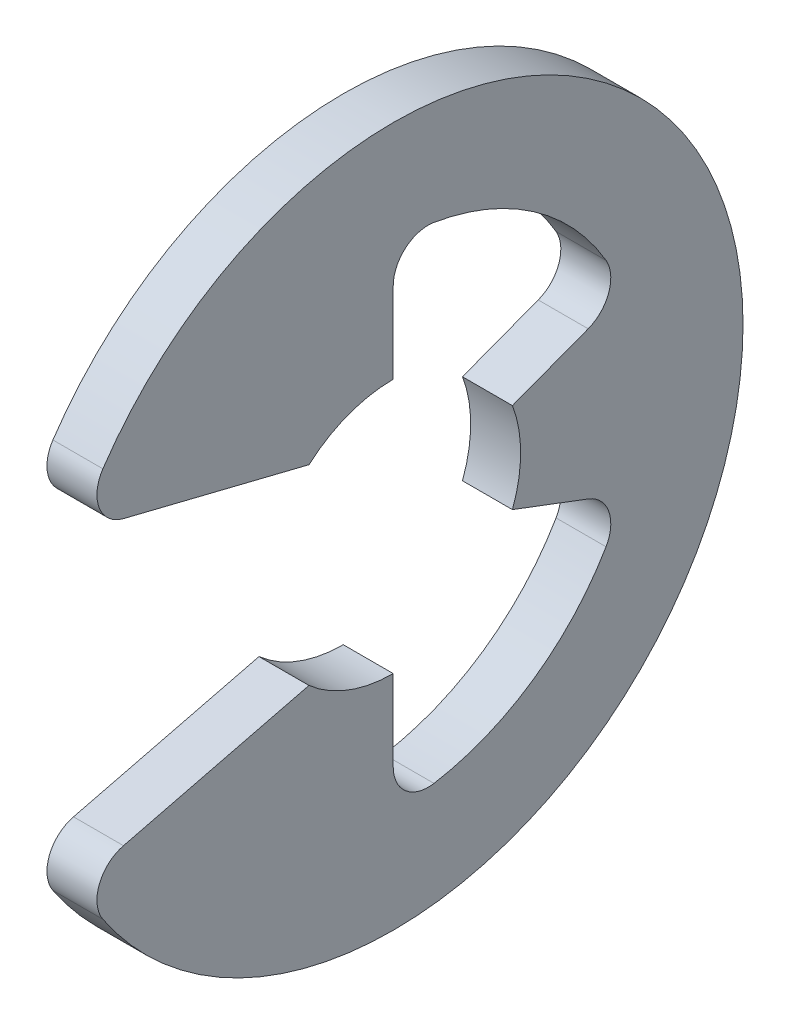
ISO-10303-21;
HEADER;
FILE_DESCRIPTION(('STEP AP214'),'2;1');
FILE_NAME('part.step','',(''),(''),'','','');
FILE_SCHEMA(('AUTOMOTIVE_DESIGN { 1 0 10303 214 1 1 1 1 }'));
ENDSEC;
DATA;
#1=APPLICATION_CONTEXT('core data for automotive mechanical design processes');
#2=APPLICATION_PROTOCOL_DEFINITION('international standard','automotive_design',2000,#1);
#3=PRODUCT_CONTEXT('',#1,'mechanical');
#4=PRODUCT('Part','Part','',(#3));
#5=PRODUCT_RELATED_PRODUCT_CATEGORY('part','',(#4));
#6=PRODUCT_DEFINITION_FORMATION('','',#4);
#7=PRODUCT_DEFINITION_CONTEXT('part definition',#1,'design');
#8=PRODUCT_DEFINITION('design','',#6,#7);
#9=PRODUCT_DEFINITION_SHAPE('','',#8);
#10=(LENGTH_UNIT() NAMED_UNIT(*) SI_UNIT(.MILLI.,.METRE.));
#11=(NAMED_UNIT(*) PLANE_ANGLE_UNIT() SI_UNIT($,.RADIAN.));
#12=(NAMED_UNIT(*) SI_UNIT($,.STERADIAN.) SOLID_ANGLE_UNIT());
#13=UNCERTAINTY_MEASURE_WITH_UNIT(LENGTH_MEASURE(1.E-05),#10,'distance_accuracy_value','');
#14=(GEOMETRIC_REPRESENTATION_CONTEXT(3) GLOBAL_UNCERTAINTY_ASSIGNED_CONTEXT((#13)) GLOBAL_UNIT_ASSIGNED_CONTEXT((#10,
#11,#12)) REPRESENTATION_CONTEXT('',''));
#15=CARTESIAN_POINT('',(0.,0.,0.));
#16=DIRECTION('',(0.,0.,1.));
#17=DIRECTION('',(1.,0.,0.));
#18=AXIS2_PLACEMENT_3D('',#15,#16,#17);
#19=CARTESIAN_POINT('',(-0.127,-1.799336,1.5257746472));
#20=DIRECTION('',(1.,0.,0.));
#21=DIRECTION('',(0.,0.,-1.));
#22=AXIS2_PLACEMENT_3D('',#19,#20,#21);
#23=PLANE('',#22);
#24=CARTESIAN_POINT('',(-0.127,-0.8923778698,1.3282702162));
#25=DIRECTION('',(-1.,0.,0.));
#26=DIRECTION('',(0.,-1.,0.));
#27=AXIS2_PLACEMENT_3D('',#24,#25,#26);
#28=CIRCLE('',#27,0.1778);
#29=CARTESIAN_POINT('',(-0.127,-0.991530970948213,1.47585579703794));
#30=VERTEX_POINT('',#29);
#31=CARTESIAN_POINT('',(-0.127,-0.719816418180298,1.37111162757117));
#32=VERTEX_POINT('',#31);
#33=EDGE_CURVE('E148',#30,#32,#28,.T.);
#34=ORIENTED_EDGE('',*,*,#33,.T.);
#35=DIRECTION('',(0.,0.240952810377831,-0.970536832464912));
#36=VECTOR('',#35,1.);
#37=CARTESIAN_POINT('',(-0.127,-0.6027957083,0.8997624626));
#38=LINE('',#37,#36);
#39=CARTESIAN_POINT('',(-0.127,-0.485774999078057,0.428413282089519));
#40=VERTEX_POINT('',#39);
#41=EDGE_CURVE('E147',#32,#40,#38,.T.);
#42=ORIENTED_EDGE('',*,*,#41,.T.);
#43=CARTESIAN_POINT('',(-0.127,0.,0.));
#44=DIRECTION('',(-1.,0.,0.));
#45=DIRECTION('',(0.,-1.,0.));
#46=AXIS2_PLACEMENT_3D('',#43,#44,#45);
#47=CIRCLE('',#46,0.6477);
#48=CARTESIAN_POINT('',(-0.127,-0.6477,-2.16789824564557E-10));
#49=VERTEX_POINT('',#48);
#50=EDGE_CURVE('E145',#49,#40,#47,.T.);
#51=ORIENTED_EDGE('',*,*,#50,.F.);
#52=DIRECTION('',(0.,1.,0.));
#53=VECTOR('',#52,1.);
#54=CARTESIAN_POINT('',(-0.127,0.,-1.84416067486315E-10));
#55=LINE('',#54,#53);
#56=CARTESIAN_POINT('',(-0.127,-1.059357038,-9.22080337431574E-11));
#57=VERTEX_POINT('',#56);
#58=EDGE_CURVE('E144',#57,#49,#55,.T.);
#59=ORIENTED_EDGE('',*,*,#58,.F.);
#60=CARTESIAN_POINT('',(-0.127,-1.059357038,-0.1778));
#61=DIRECTION('',(-1.,0.,0.));
#62=DIRECTION('',(0.,-1.,0.));
#63=AXIS2_PLACEMENT_3D('',#60,#61,#62);
#64=CIRCLE('',#63,0.1778);
#65=CARTESIAN_POINT('',(-0.127,-1.23470447799844,-0.20722990276032));
#66=VERTEX_POINT('',#65);
#67=EDGE_CURVE('E142',#66,#57,#64,.T.);
#68=ORIENTED_EDGE('',*,*,#67,.F.);
#69=CARTESIAN_POINT('',(-0.127,0.,0.));
#70=DIRECTION('',(-1.,0.,0.));
#71=DIRECTION('',(0.,-1.,0.));
#72=AXIS2_PLACEMENT_3D('',#69,#70,#71);
#73=CIRCLE('',#72,1.2519742042);
#74=CARTESIAN_POINT('',(-0.127,-0.630379775952262,-1.08169345699548));
#75=VERTEX_POINT('',#74);
#76=EDGE_CURVE('E140',#75,#66,#73,.T.);
#77=ORIENTED_EDGE('',*,*,#76,.F.);
#78=CARTESIAN_POINT('',(-0.127,-0.5408559414,-0.928075995));
#79=DIRECTION('',(-1.,0.,0.));
#80=DIRECTION('',(0.,-1.,0.));
#81=AXIS2_PLACEMENT_3D('',#78,#79,#80);
#82=CIRCLE('',#81,0.1778);
#83=CARTESIAN_POINT('',(-0.127,-0.374539275143704,-0.990937789013892));
#84=VERTEX_POINT('',#83);
#85=EDGE_CURVE('E138',#84,#75,#82,.T.);
#86=ORIENTED_EDGE('',*,*,#85,.F.);
#87=DIRECTION('',(0.,0.353553418854302,0.93541433601182));
#88=VECTOR('',#87,1.);
#89=CARTESIAN_POINT('',(-0.127,-0.3745392814,-0.990937794600001));
#90=LINE('',#89,#88);
#91=CARTESIAN_POINT('',(-0.127,-0.228996519461306,-0.605867876562199));
#92=VERTEX_POINT('',#91);
#93=EDGE_CURVE('E136',#92,#84,#90,.F.);
#94=ORIENTED_EDGE('',*,*,#93,.F.);
#95=CARTESIAN_POINT('',(-0.127,0.,0.));
#96=DIRECTION('',(-1.,0.,0.));
#97=DIRECTION('',(0.,-1.,0.));
#98=AXIS2_PLACEMENT_3D('',#95,#96,#97);
#99=CIRCLE('',#98,0.6477);
#100=CARTESIAN_POINT('',(-0.127,0.228996525208933,-0.605867874575171));
#101=VERTEX_POINT('',#100);
#102=EDGE_CURVE('E134',#101,#92,#99,.T.);
#103=ORIENTED_EDGE('',*,*,#102,.F.);
#104=DIRECTION('',(0.,0.353553418854302,-0.93541433601182));
#105=VECTOR('',#104,1.);
#106=CARTESIAN_POINT('',(-0.127,0.2289965194,-0.6058678764));
#107=LINE('',#106,#105);
#108=CARTESIAN_POINT('',(-0.127,0.374539280555376,-0.990937792365336));
#109=VERTEX_POINT('',#108);
#110=EDGE_CURVE('E132',#109,#101,#107,.F.);
#111=ORIENTED_EDGE('',*,*,#110,.F.);
#112=CARTESIAN_POINT('',(-0.127,0.5408559414,-0.928075995));
#113=DIRECTION('',(-1.,0.,0.));
#114=DIRECTION('',(0.,-1.,0.));
#115=AXIS2_PLACEMENT_3D('',#112,#113,#114);
#116=CIRCLE('',#115,0.1778);
#117=CARTESIAN_POINT('',(-0.127,0.630379772649934,-1.08169345891998));
#118=VERTEX_POINT('',#117);
#119=EDGE_CURVE('E130',#118,#109,#116,.T.);
#120=ORIENTED_EDGE('',*,*,#119,.F.);
#121=CARTESIAN_POINT('',(-0.127,0.,0.));
#122=DIRECTION('',(-1.,0.,0.));
#123=DIRECTION('',(0.,-1.,0.));
#124=AXIS2_PLACEMENT_3D('',#121,#122,#123);
#125=CIRCLE('',#124,1.2519742042);
#126=CARTESIAN_POINT('',(-0.127,1.23470447811351,-0.207229902074691));
#127=VERTEX_POINT('',#126);
#128=EDGE_CURVE('E128',#127,#118,#125,.T.);
#129=ORIENTED_EDGE('',*,*,#128,.F.);
#130=CARTESIAN_POINT('',(-0.127,1.059357038,-0.1778));
#131=DIRECTION('',(-1.,0.,0.));
#132=DIRECTION('',(0.,-1.,0.));
#133=AXIS2_PLACEMENT_3D('',#130,#131,#132);
#134=CIRCLE('',#133,0.1778);
#135=CARTESIAN_POINT('',(-0.127,1.059357038,-9.22080337431574E-11));
#136=VERTEX_POINT('',#135);
#137=EDGE_CURVE('E126',#136,#127,#134,.T.);
#138=ORIENTED_EDGE('',*,*,#137,.F.);
#139=DIRECTION('',(0.,1.,0.));
#140=VECTOR('',#139,1.);
#141=CARTESIAN_POINT('',(-0.127,0.,-1.84416067486315E-10));
#142=LINE('',#141,#140);
#143=CARTESIAN_POINT('',(-0.127,0.6477,-9.22080337431574E-11));
#144=VERTEX_POINT('',#143);
#145=EDGE_CURVE('E123',#144,#136,#142,.T.);
#146=ORIENTED_EDGE('',*,*,#145,.F.);
#147=CARTESIAN_POINT('',(-0.127,0.,0.));
#148=DIRECTION('',(-1.,0.,0.));
#149=DIRECTION('',(0.,-1.,0.));
#150=AXIS2_PLACEMENT_3D('',#147,#148,#149);
#151=CIRCLE('',#150,0.6477);
#152=CARTESIAN_POINT('',(-0.127,0.485774999035622,0.428413287115569));
#153=VERTEX_POINT('',#152);
#154=EDGE_CURVE('E122',#153,#144,#151,.T.);
#155=ORIENTED_EDGE('',*,*,#154,.F.);
#156=DIRECTION('',(0.,0.240952810377831,0.970536832464912));
#157=VECTOR('',#156,1.);
#158=CARTESIAN_POINT('',(-0.127,0.485775,0.428413291));
#159=LINE('',#158,#157);
#160=CARTESIAN_POINT('',(-0.127,0.719816418176451,1.37111162755568));
#161=VERTEX_POINT('',#160);
#162=EDGE_CURVE('E115',#161,#153,#159,.F.);
#163=ORIENTED_EDGE('',*,*,#162,.F.);
#164=CARTESIAN_POINT('',(-0.127,0.8923778698,1.3282702162));
#165=DIRECTION('',(-1.,0.,0.));
#166=DIRECTION('',(0.,-1.,0.));
#167=AXIS2_PLACEMENT_3D('',#164,#165,#166);
#168=CIRCLE('',#167,0.1778);
#169=CARTESIAN_POINT('',(-0.127,0.99153096688157,1.4758557959127));
#170=VERTEX_POINT('',#169);
#171=EDGE_CURVE('E19',#170,#161,#168,.F.);
#172=ORIENTED_EDGE('',*,*,#171,.F.);
#173=CARTESIAN_POINT('',(-0.127,0.,0.));
#174=DIRECTION('',(-1.,0.,0.));
#175=DIRECTION('',(0.,-1.,0.));
#176=AXIS2_PLACEMENT_3D('',#173,#174,#175);
#177=CIRCLE('',#176,1.778);
#178=EDGE_CURVE('E150',#170,#30,#177,.T.);
#179=ORIENTED_EDGE('',*,*,#178,.T.);
#180=EDGE_LOOP('',(#34,#42,#51,#59,#68,#77,#86,#94,#103,#111,#120,#129,#138,#146,#155,#163,#172,#179));
#181=FACE_BOUND('',#180,.T.);
#182=ADVANCED_FACE('F15',(#181),#23,.F.);
#183=CARTESIAN_POINT('',(-0.127,-0.7198164166,1.3711116342));
#184=DIRECTION('',(0.,-0.970536832464912,-0.240952810377831));
#185=DIRECTION('',(0.,0.240952810377831,-0.970536832464912));
#186=AXIS2_PLACEMENT_3D('',#183,#184,#185);
#187=PLANE('',#186);
#188=DIRECTION('',(-1.,0.,0.));
#189=VECTOR('',#188,1.);
#190=CARTESIAN_POINT('',(0.,-0.719816421450301,1.37111162774834));
#191=LINE('',#190,#189);
#192=CARTESIAN_POINT('',(0.127,-0.719816423595553,1.37111162716025));
#193=VERTEX_POINT('',#192);
#194=EDGE_CURVE('E151',#32,#193,#191,.F.);
#195=ORIENTED_EDGE('',*,*,#194,.T.);
#196=DIRECTION('',(0.,-0.240952820268791,0.970536830009308));
#197=VECTOR('',#196,1.);
#198=CARTESIAN_POINT('',(0.127,-0.48577499887224,0.428413283093616));
#199=LINE('',#198,#197);
#200=CARTESIAN_POINT('',(0.127,-0.485774999403899,0.428413281720049));
#201=VERTEX_POINT('',#200);
#202=EDGE_CURVE('E154',#201,#193,#199,.T.);
#203=ORIENTED_EDGE('',*,*,#202,.F.);
#204=DIRECTION('',(-1.,0.,0.));
#205=VECTOR('',#204,1.);
#206=CARTESIAN_POINT('',(0.,-0.485775000084871,0.428413280947899));
#207=LINE('',#206,#205);
#208=EDGE_CURVE('E240',#40,#201,#207,.F.);
#209=ORIENTED_EDGE('',*,*,#208,.F.);
#210=ORIENTED_EDGE('',*,*,#41,.F.);
#211=EDGE_LOOP('',(#195,#203,#209,#210));
#212=FACE_BOUND('',#211,.T.);
#213=ADVANCED_FACE('F265',(#212),#187,.F.);
#214=CARTESIAN_POINT('',(0.127,-0.8923778698,1.3282702162));
#215=DIRECTION('',(-1.,0.,0.));
#216=DIRECTION('',(0.,-1.,0.));
#217=AXIS2_PLACEMENT_3D('',#214,#215,#216);
#218=CYLINDRICAL_SURFACE('',#217,0.1778);
#219=CARTESIAN_POINT('',(0.127,-0.8923778698,1.3282702162));
#220=DIRECTION('',(-1.,0.,0.));
#221=DIRECTION('',(0.,-1.,0.));
#222=AXIS2_PLACEMENT_3D('',#219,#220,#221);
#223=CIRCLE('',#222,0.1778);
#224=CARTESIAN_POINT('',(0.127,-0.991530970948213,1.47585579703794));
#225=VERTEX_POINT('',#224);
#226=EDGE_CURVE('E157',#193,#225,#223,.F.);
#227=ORIENTED_EDGE('',*,*,#226,.F.);
#228=ORIENTED_EDGE('',*,*,#194,.F.);
#229=ORIENTED_EDGE('',*,*,#33,.F.);
#230=DIRECTION('',(-1.,0.,0.));
#231=VECTOR('',#230,1.);
#232=CARTESIAN_POINT('',(0.,-0.991530973468016,1.47585579534505));
#233=LINE('',#232,#231);
#234=EDGE_CURVE('E153',#30,#225,#233,.F.);
#235=ORIENTED_EDGE('',*,*,#234,.T.);
#236=EDGE_LOOP('',(#227,#228,#229,#235));
#237=FACE_BOUND('',#236,.T.);
#238=ADVANCED_FACE('F315',(#237),#218,.T.);
#239=CARTESIAN_POINT('',(0.127,0.,0.));
#240=DIRECTION('',(-1.,0.,0.));
#241=DIRECTION('',(0.,-1.,0.));
#242=AXIS2_PLACEMENT_3D('',#239,#240,#241);
#243=CYLINDRICAL_SURFACE('',#242,1.778);
#244=ORIENTED_EDGE('',*,*,#234,.F.);
#245=ORIENTED_EDGE('',*,*,#178,.F.);
#246=DIRECTION('',(-1.,0.,0.));
#247=VECTOR('',#246,1.);
#248=CARTESIAN_POINT('',(0.,0.991530967120298,1.47585579575231));
#249=LINE('',#248,#247);
#250=CARTESIAN_POINT('',(0.127,0.99153096688157,1.4758557959127));
#251=VERTEX_POINT('',#250);
#252=EDGE_CURVE('E111',#170,#251,#249,.F.);
#253=ORIENTED_EDGE('',*,*,#252,.T.);
#254=CARTESIAN_POINT('',(0.127,0.,0.));
#255=DIRECTION('',(-1.,0.,0.));
#256=DIRECTION('',(0.,-1.,0.));
#257=AXIS2_PLACEMENT_3D('',#254,#255,#256);
#258=CIRCLE('',#257,1.778);
#259=EDGE_CURVE('E160',#225,#251,#258,.F.);
#260=ORIENTED_EDGE('',*,*,#259,.F.);
#261=EDGE_LOOP('',(#244,#245,#253,#260));
#262=FACE_BOUND('',#261,.T.);
#263=ADVANCED_FACE('F313',(#262),#243,.T.);
#264=CARTESIAN_POINT('',(0.127,0.,0.));
#265=DIRECTION('',(-1.,0.,0.));
#266=DIRECTION('',(0.,-1.,0.));
#267=AXIS2_PLACEMENT_3D('',#264,#265,#266);
#268=CYLINDRICAL_SURFACE('',#267,0.6477);
#269=CARTESIAN_POINT('',(0.127,0.,0.));
#270=DIRECTION('',(-1.,0.,0.));
#271=DIRECTION('',(0.,-1.,0.));
#272=AXIS2_PLACEMENT_3D('',#269,#270,#271);
#273=CIRCLE('',#272,0.6477);
#274=CARTESIAN_POINT('',(0.127,0.485774999361464,0.428413286746099));
#275=VERTEX_POINT('',#274);
#276=CARTESIAN_POINT('',(0.127,0.6477,-9.22080337431574E-11));
#277=VERTEX_POINT('',#276);
#278=EDGE_CURVE('E164',#275,#277,#273,.T.);
#279=ORIENTED_EDGE('',*,*,#278,.F.);
#280=DIRECTION('',(-1.,0.,0.));
#281=VECTOR('',#280,1.);
#282=CARTESIAN_POINT('',(0.,0.485775,0.428413291));
#283=LINE('',#282,#281);
#284=EDGE_CURVE('E205',#275,#153,#283,.T.);
#285=ORIENTED_EDGE('',*,*,#284,.T.);
#286=ORIENTED_EDGE('',*,*,#154,.T.);
#287=DIRECTION('',(1.,0.,0.));
#288=VECTOR('',#287,1.);
#289=CARTESIAN_POINT('',(0.,0.6477,0.));
#290=LINE('',#289,#288);
#291=EDGE_CURVE('E203',#144,#277,#290,.T.);
#292=ORIENTED_EDGE('',*,*,#291,.T.);
#293=EDGE_LOOP('',(#279,#285,#286,#292));
#294=FACE_BOUND('',#293,.T.);
#295=ADVANCED_FACE('F309',(#294),#268,.F.);
#296=CARTESIAN_POINT('',(-0.127,1.059357038,0.));
#297=DIRECTION('',(0.,0.,1.));
#298=DIRECTION('',(0.,-1.,0.));
#299=AXIS2_PLACEMENT_3D('',#296,#297,#298);
#300=PLANE('',#299);
#301=DIRECTION('',(1.,0.,0.));
#302=VECTOR('',#301,1.);
#303=CARTESIAN_POINT('',(0.,1.059357038,0.));
#304=LINE('',#303,#302);
#305=CARTESIAN_POINT('',(0.127,1.059357038,-9.22080337431574E-11));
#306=VERTEX_POINT('',#305);
#307=EDGE_CURVE('E210',#306,#136,#304,.F.);
#308=ORIENTED_EDGE('',*,*,#307,.F.);
#309=DIRECTION('',(0.,1.,0.));
#310=VECTOR('',#309,1.);
#311=CARTESIAN_POINT('',(0.127,0.,-1.84416067486315E-10));
#312=LINE('',#311,#310);
#313=EDGE_CURVE('E167',#277,#306,#312,.T.);
#314=ORIENTED_EDGE('',*,*,#313,.F.);
#315=ORIENTED_EDGE('',*,*,#291,.F.);
#316=ORIENTED_EDGE('',*,*,#145,.T.);
#317=EDGE_LOOP('',(#308,#314,#315,#316));
#318=FACE_BOUND('',#317,.T.);
#319=ADVANCED_FACE('F307',(#318),#300,.F.);
#320=CARTESIAN_POINT('',(0.127,1.059357038,-0.1778));
#321=DIRECTION('',(-1.,0.,0.));
#322=DIRECTION('',(0.,-1.,0.));
#323=AXIS2_PLACEMENT_3D('',#320,#321,#322);
#324=CYLINDRICAL_SURFACE('',#323,0.1778);
#325=ORIENTED_EDGE('',*,*,#137,.T.);
#326=DIRECTION('',(1.,0.,0.));
#327=VECTOR('',#326,1.);
#328=CARTESIAN_POINT('',(0.,1.23470448905142,-0.207229903002661));
#329=LINE('',#328,#327);
#330=CARTESIAN_POINT('',(0.127,1.23470448890323,-0.207229903885611));
#331=VERTEX_POINT('',#330);
#332=EDGE_CURVE('E213',#331,#127,#329,.F.);
#333=ORIENTED_EDGE('',*,*,#332,.F.);
#334=CARTESIAN_POINT('',(0.127,1.059357038,-0.1778));
#335=DIRECTION('',(-1.,0.,0.));
#336=DIRECTION('',(0.,-1.,0.));
#337=AXIS2_PLACEMENT_3D('',#334,#335,#336);
#338=CIRCLE('',#337,0.1778);
#339=EDGE_CURVE('E168',#306,#331,#338,.T.);
#340=ORIENTED_EDGE('',*,*,#339,.F.);
#341=ORIENTED_EDGE('',*,*,#307,.T.);
#342=EDGE_LOOP('',(#325,#333,#340,#341));
#343=FACE_BOUND('',#342,.T.);
#344=ADVANCED_FACE('F297',(#343),#324,.F.);
#345=CARTESIAN_POINT('',(0.127,0.,0.));
#346=DIRECTION('',(-1.,0.,0.));
#347=DIRECTION('',(0.,-1.,0.));
#348=AXIS2_PLACEMENT_3D('',#345,#346,#347);
#349=CYLINDRICAL_SURFACE('',#348,1.2519742042);
#350=ORIENTED_EDGE('',*,*,#128,.T.);
#351=DIRECTION('',(1.,0.,0.));
#352=VECTOR('',#351,1.);
#353=CARTESIAN_POINT('',(0.,0.630379770971365,-1.08169345474621));
#354=LINE('',#353,#352);
#355=CARTESIAN_POINT('',(0.127,0.630379770408678,-1.08169345507412));
#356=VERTEX_POINT('',#355);
#357=EDGE_CURVE('E216',#356,#118,#354,.F.);
#358=ORIENTED_EDGE('',*,*,#357,.F.);
#359=CARTESIAN_POINT('',(0.127,0.,0.));
#360=DIRECTION('',(-1.,0.,0.));
#361=DIRECTION('',(0.,-1.,0.));
#362=AXIS2_PLACEMENT_3D('',#359,#360,#361);
#363=CIRCLE('',#362,1.2519742042);
#364=EDGE_CURVE('E171',#331,#356,#363,.T.);
#365=ORIENTED_EDGE('',*,*,#364,.F.);
#366=ORIENTED_EDGE('',*,*,#332,.T.);
#367=EDGE_LOOP('',(#350,#358,#365,#366));
#368=FACE_BOUND('',#367,.T.);
#369=ADVANCED_FACE('F301',(#368),#349,.F.);
#370=CARTESIAN_POINT('',(0.127,0.5408559414,-0.928075995));
#371=DIRECTION('',(-1.,0.,0.));
#372=DIRECTION('',(0.,-1.,0.));
#373=AXIS2_PLACEMENT_3D('',#370,#371,#372);
#374=CYLINDRICAL_SURFACE('',#373,0.1778);
#375=ORIENTED_EDGE('',*,*,#119,.T.);
#376=DIRECTION('',(1.,0.,0.));
#377=VECTOR('',#376,1.);
#378=CARTESIAN_POINT('',(0.,0.3745392814,-0.990937794600001));
#379=LINE('',#378,#377);
#380=CARTESIAN_POINT('',(0.127,0.374539278939973,-0.990937790299362));
#381=VERTEX_POINT('',#380);
#382=EDGE_CURVE('E219',#109,#381,#379,.T.);
#383=ORIENTED_EDGE('',*,*,#382,.T.);
#384=CARTESIAN_POINT('',(0.127,0.5408559414,-0.928075995));
#385=DIRECTION('',(-1.,0.,0.));
#386=DIRECTION('',(0.,-1.,0.));
#387=AXIS2_PLACEMENT_3D('',#384,#385,#386);
#388=CIRCLE('',#387,0.1778);
#389=EDGE_CURVE('E174',#356,#381,#388,.T.);
#390=ORIENTED_EDGE('',*,*,#389,.F.);
#391=ORIENTED_EDGE('',*,*,#357,.T.);
#392=EDGE_LOOP('',(#375,#383,#390,#391));
#393=FACE_BOUND('',#392,.T.);
#394=ADVANCED_FACE('F339',(#393),#374,.F.);
#395=CARTESIAN_POINT('',(-0.127,0.2289965194,-0.6058678764));
#396=DIRECTION('',(0.,-0.93541433601182,-0.353553418854302));
#397=DIRECTION('',(0.,0.353553418854302,-0.93541433601182));
#398=AXIS2_PLACEMENT_3D('',#395,#396,#397);
#399=PLANE('',#398);
#400=ORIENTED_EDGE('',*,*,#382,.F.);
#401=ORIENTED_EDGE('',*,*,#110,.T.);
#402=DIRECTION('',(1.,0.,0.));
#403=VECTOR('',#402,1.);
#404=CARTESIAN_POINT('',(0.,0.228996530895255,-0.605867872425943));
#405=LINE('',#404,#403);
#406=CARTESIAN_POINT('',(0.127,0.228996529901035,-0.605867872801723));
#407=VERTEX_POINT('',#406);
#408=EDGE_CURVE('E222',#407,#101,#405,.F.);
#409=ORIENTED_EDGE('',*,*,#408,.F.);
#410=DIRECTION('',(0.,-0.353553392510416,0.935414345968874));
#411=VECTOR('',#410,1.);
#412=CARTESIAN_POINT('',(0.127,0.374539277236432,-0.990937788000198));
#413=LINE('',#412,#411);
#414=EDGE_CURVE('E177',#381,#407,#413,.T.);
#415=ORIENTED_EDGE('',*,*,#414,.F.);
#416=EDGE_LOOP('',(#400,#401,#409,#415));
#417=FACE_BOUND('',#416,.T.);
#418=ADVANCED_FACE('F335',(#417),#399,.F.);
#419=CARTESIAN_POINT('',(0.127,0.,0.));
#420=DIRECTION('',(-1.,0.,0.));
#421=DIRECTION('',(0.,-1.,0.));
#422=AXIS2_PLACEMENT_3D('',#419,#420,#421);
#423=CYLINDRICAL_SURFACE('',#422,0.6477);
#424=CARTESIAN_POINT('',(0.127,0.,0.));
#425=DIRECTION('',(-1.,0.,0.));
#426=DIRECTION('',(0.,-1.,0.));
#427=AXIS2_PLACEMENT_3D('',#424,#425,#426);
#428=CIRCLE('',#427,0.6477);
#429=CARTESIAN_POINT('',(0.127,-0.228996524153408,-0.605867874788751));
#430=VERTEX_POINT('',#429);
#431=EDGE_CURVE('E180',#407,#430,#428,.T.);
#432=ORIENTED_EDGE('',*,*,#431,.F.);
#433=ORIENTED_EDGE('',*,*,#408,.T.);
#434=ORIENTED_EDGE('',*,*,#102,.T.);
#435=DIRECTION('',(1.,0.,0.));
#436=VECTOR('',#435,1.);
#437=CARTESIAN_POINT('',(0.,-0.2289965194,-0.6058678764));
#438=LINE('',#437,#436);
#439=EDGE_CURVE('E225',#92,#430,#438,.T.);
#440=ORIENTED_EDGE('',*,*,#439,.T.);
#441=EDGE_LOOP('',(#432,#433,#434,#440));
#442=FACE_BOUND('',#441,.T.);
#443=ADVANCED_FACE('F338',(#442),#423,.F.);
#444=CARTESIAN_POINT('',(-0.127,-0.3745392814,-0.990937794600001));
#445=DIRECTION('',(0.,0.93541433601182,-0.353553418854302));
#446=DIRECTION('',(0.,0.353553418854302,0.93541433601182));
#447=AXIS2_PLACEMENT_3D('',#444,#445,#446);
#448=PLANE('',#447);
#449=DIRECTION('',(1.,0.,0.));
#450=VECTOR('',#449,1.);
#451=CARTESIAN_POINT('',(0.,-0.374539270576656,-0.990937787897113));
#452=LINE('',#451,#450);
#453=CARTESIAN_POINT('',(0.127,-0.374539273528301,-0.990937786947918));
#454=VERTEX_POINT('',#453);
#455=EDGE_CURVE('E228',#454,#84,#452,.F.);
#456=ORIENTED_EDGE('',*,*,#455,.F.);
#457=DIRECTION('',(0.,-0.353553392510414,-0.935414345968874));
#458=VECTOR('',#457,1.);
#459=CARTESIAN_POINT('',(0.127,-0.228996530151312,-0.605867876470131));
#460=LINE('',#459,#458);
#461=EDGE_CURVE('E183',#430,#454,#460,.T.);
#462=ORIENTED_EDGE('',*,*,#461,.F.);
#463=ORIENTED_EDGE('',*,*,#439,.F.);
#464=ORIENTED_EDGE('',*,*,#93,.T.);
#465=EDGE_LOOP('',(#456,#462,#463,#464));
#466=FACE_BOUND('',#465,.T.);
#467=ADVANCED_FACE('F341',(#466),#448,.F.);
#468=CARTESIAN_POINT('',(0.127,-0.5408559414,-0.928075995));
#469=DIRECTION('',(-1.,0.,0.));
#470=DIRECTION('',(0.,-1.,0.));
#471=AXIS2_PLACEMENT_3D('',#468,#469,#470);
#472=CYLINDRICAL_SURFACE('',#471,0.1778);
#473=ORIENTED_EDGE('',*,*,#85,.T.);
#474=DIRECTION('',(1.,0.,0.));
#475=VECTOR('',#474,1.);
#476=CARTESIAN_POINT('',(0.,-0.630379782058533,-1.08169345858892));
#477=LINE('',#476,#475);
#478=CARTESIAN_POINT('',(0.127,-0.630379778193518,-1.08169346084134));
#479=VERTEX_POINT('',#478);
#480=EDGE_CURVE('E231',#479,#75,#477,.F.);
#481=ORIENTED_EDGE('',*,*,#480,.F.);
#482=CARTESIAN_POINT('',(0.127,-0.5408559414,-0.928075995));
#483=DIRECTION('',(-1.,0.,0.));
#484=DIRECTION('',(0.,-1.,0.));
#485=AXIS2_PLACEMENT_3D('',#482,#483,#484);
#486=CIRCLE('',#485,0.1778);
#487=EDGE_CURVE('E186',#454,#479,#486,.T.);
#488=ORIENTED_EDGE('',*,*,#487,.F.);
#489=ORIENTED_EDGE('',*,*,#455,.T.);
#490=EDGE_LOOP('',(#473,#481,#488,#489));
#491=FACE_BOUND('',#490,.T.);
#492=ADVANCED_FACE('F344',(#491),#472,.F.);
#493=CARTESIAN_POINT('',(0.127,0.,0.));
#494=DIRECTION('',(-1.,0.,0.));
#495=DIRECTION('',(0.,-1.,0.));
#496=AXIS2_PLACEMENT_3D('',#493,#494,#495);
#497=CYLINDRICAL_SURFACE('',#496,1.2519742042);
#498=CARTESIAN_POINT('',(0.127,0.,0.));
#499=DIRECTION('',(-1.,0.,0.));
#500=DIRECTION('',(0.,-1.,0.));
#501=AXIS2_PLACEMENT_3D('',#498,#499,#500);
#502=CIRCLE('',#501,1.2519742042);
#503=CARTESIAN_POINT('',(0.127,-1.23470446720872,-0.207229900949399));
#504=VERTEX_POINT('',#503);
#505=EDGE_CURVE('E189',#479,#504,#502,.T.);
#506=ORIENTED_EDGE('',*,*,#505,.F.);
#507=ORIENTED_EDGE('',*,*,#480,.T.);
#508=ORIENTED_EDGE('',*,*,#76,.T.);
#509=DIRECTION('',(1.,0.,0.));
#510=VECTOR('',#509,1.);
#511=CARTESIAN_POINT('',(0.,-1.23470446724184,-0.207229900752077));
#512=LINE('',#511,#510);
#513=EDGE_CURVE('E234',#504,#66,#512,.F.);
#514=ORIENTED_EDGE('',*,*,#513,.F.);
#515=EDGE_LOOP('',(#506,#507,#508,#514));
#516=FACE_BOUND('',#515,.T.);
#517=ADVANCED_FACE('F357',(#516),#497,.F.);
#518=CARTESIAN_POINT('',(0.127,-1.059357038,-0.1778));
#519=DIRECTION('',(-1.,0.,0.));
#520=DIRECTION('',(0.,-1.,0.));
#521=AXIS2_PLACEMENT_3D('',#518,#519,#520);
#522=CYLINDRICAL_SURFACE('',#521,0.1778);
#523=ORIENTED_EDGE('',*,*,#67,.T.);
#524=DIRECTION('',(1.,0.,0.));
#525=VECTOR('',#524,1.);
#526=CARTESIAN_POINT('',(0.,-1.059357038,0.));
#527=LINE('',#526,#525);
#528=CARTESIAN_POINT('',(0.127,-1.059357038,-9.22080337431574E-11));
#529=VERTEX_POINT('',#528);
#530=EDGE_CURVE('E237',#57,#529,#527,.T.);
#531=ORIENTED_EDGE('',*,*,#530,.T.);
#532=CARTESIAN_POINT('',(0.127,-1.059357038,-0.1778));
#533=DIRECTION('',(-1.,0.,0.));
#534=DIRECTION('',(0.,-1.,0.));
#535=AXIS2_PLACEMENT_3D('',#532,#533,#534);
#536=CIRCLE('',#535,0.1778);
#537=EDGE_CURVE('E192',#504,#529,#536,.T.);
#538=ORIENTED_EDGE('',*,*,#537,.F.);
#539=ORIENTED_EDGE('',*,*,#513,.T.);
#540=EDGE_LOOP('',(#523,#531,#538,#539));
#541=FACE_BOUND('',#540,.T.);
#542=ADVANCED_FACE('F347',(#541),#522,.F.);
#543=CARTESIAN_POINT('',(-0.127,-0.6477,0.));
#544=DIRECTION('',(0.,0.,1.));
#545=DIRECTION('',(0.,-1.,0.));
#546=AXIS2_PLACEMENT_3D('',#543,#544,#545);
#547=PLANE('',#546);
#548=ORIENTED_EDGE('',*,*,#530,.F.);
#549=ORIENTED_EDGE('',*,*,#58,.T.);
#550=DIRECTION('',(1.,0.,0.));
#551=VECTOR('',#550,1.);
#552=CARTESIAN_POINT('',(0.,-0.6477,-2.49163581642798E-10));
#553=LINE('',#552,#551);
#554=CARTESIAN_POINT('',(0.127,-0.6477,-2.16789824564557E-10));
#555=VERTEX_POINT('',#554);
#556=EDGE_CURVE('E207',#555,#49,#553,.F.);
#557=ORIENTED_EDGE('',*,*,#556,.F.);
#558=DIRECTION('',(0.,1.,0.));
#559=VECTOR('',#558,1.);
#560=CARTESIAN_POINT('',(0.127,0.,-1.84416067486315E-10));
#561=LINE('',#560,#559);
#562=EDGE_CURVE('E195',#529,#555,#561,.T.);
#563=ORIENTED_EDGE('',*,*,#562,.F.);
#564=EDGE_LOOP('',(#548,#549,#557,#563));
#565=FACE_BOUND('',#564,.T.);
#566=ADVANCED_FACE('F253',(#565),#547,.F.);
#567=CARTESIAN_POINT('',(0.127,0.,0.));
#568=DIRECTION('',(-1.,0.,0.));
#569=DIRECTION('',(0.,-1.,0.));
#570=AXIS2_PLACEMENT_3D('',#567,#568,#569);
#571=CYLINDRICAL_SURFACE('',#570,0.6477);
#572=CARTESIAN_POINT('',(0.127,0.,0.));
#573=DIRECTION('',(-1.,0.,0.));
#574=DIRECTION('',(0.,-1.,0.));
#575=AXIS2_PLACEMENT_3D('',#572,#573,#574);
#576=CIRCLE('',#575,0.6477);
#577=EDGE_CURVE('E118',#555,#201,#576,.T.);
#578=ORIENTED_EDGE('',*,*,#577,.F.);
#579=ORIENTED_EDGE('',*,*,#556,.T.);
#580=ORIENTED_EDGE('',*,*,#50,.T.);
#581=ORIENTED_EDGE('',*,*,#208,.T.);
#582=EDGE_LOOP('',(#578,#579,#580,#581));
#583=FACE_BOUND('',#582,.T.);
#584=ADVANCED_FACE('F259',(#583),#571,.F.);
#585=CARTESIAN_POINT('',(-0.127,0.485775,0.428413291));
#586=DIRECTION('',(0.,0.970536832464912,-0.240952810377831));
#587=DIRECTION('',(0.,0.240952810377831,0.970536832464912));
#588=AXIS2_PLACEMENT_3D('',#585,#586,#587);
#589=PLANE('',#588);
#590=DIRECTION('',(1.,0.,0.));
#591=VECTOR('',#590,1.);
#592=CARTESIAN_POINT('',(0.,0.719816421442607,1.37111162771735));
#593=LINE('',#592,#591);
#594=CARTESIAN_POINT('',(0.127,0.719816423591706,1.37111162714475));
#595=VERTEX_POINT('',#594);
#596=EDGE_CURVE('E25',#595,#161,#593,.F.);
#597=ORIENTED_EDGE('',*,*,#596,.T.);
#598=ORIENTED_EDGE('',*,*,#162,.T.);
#599=ORIENTED_EDGE('',*,*,#284,.F.);
#600=DIRECTION('',(0.,-0.240952820268791,-0.970536830009308));
#601=VECTOR('',#600,1.);
#602=CARTESIAN_POINT('',(0.127,0.719816428129568,1.37111163619389));
#603=LINE('',#602,#601);
#604=EDGE_CURVE('E34',#595,#275,#603,.T.);
#605=ORIENTED_EDGE('',*,*,#604,.F.);
#606=EDGE_LOOP('',(#597,#598,#599,#605));
#607=FACE_BOUND('',#606,.T.);
#608=ADVANCED_FACE('F116',(#607),#589,.F.);
#609=CARTESIAN_POINT('',(0.127,-1.799336,1.5257746472));
#610=DIRECTION('',(1.,0.,0.));
#611=DIRECTION('',(0.,0.,-1.));
#612=AXIS2_PLACEMENT_3D('',#609,#610,#611);
#613=PLANE('',#612);
#614=ORIENTED_EDGE('',*,*,#562,.T.);
#615=ORIENTED_EDGE('',*,*,#577,.T.);
#616=ORIENTED_EDGE('',*,*,#202,.T.);
#617=ORIENTED_EDGE('',*,*,#226,.T.);
#618=ORIENTED_EDGE('',*,*,#259,.T.);
#619=CARTESIAN_POINT('',(0.127,0.8923778698,1.3282702162));
#620=DIRECTION('',(-1.,0.,0.));
#621=DIRECTION('',(0.,-1.,0.));
#622=AXIS2_PLACEMENT_3D('',#619,#620,#621);
#623=CIRCLE('',#622,0.1778);
#624=EDGE_CURVE('E10',#251,#595,#623,.F.);
#625=ORIENTED_EDGE('',*,*,#624,.T.);
#626=ORIENTED_EDGE('',*,*,#604,.T.);
#627=ORIENTED_EDGE('',*,*,#278,.T.);
#628=ORIENTED_EDGE('',*,*,#313,.T.);
#629=ORIENTED_EDGE('',*,*,#339,.T.);
#630=ORIENTED_EDGE('',*,*,#364,.T.);
#631=ORIENTED_EDGE('',*,*,#389,.T.);
#632=ORIENTED_EDGE('',*,*,#414,.T.);
#633=ORIENTED_EDGE('',*,*,#431,.T.);
#634=ORIENTED_EDGE('',*,*,#461,.T.);
#635=ORIENTED_EDGE('',*,*,#487,.T.);
#636=ORIENTED_EDGE('',*,*,#505,.T.);
#637=ORIENTED_EDGE('',*,*,#537,.T.);
#638=EDGE_LOOP('',(#614,#615,#616,#617,#618,#625,#626,#627,#628,#629,#630,#631,#632,#633,#634,
#635,#636,#637));
#639=FACE_BOUND('',#638,.T.);
#640=ADVANCED_FACE('F17',(#639),#613,.T.);
#641=CARTESIAN_POINT('',(0.127,0.8923778698,1.3282702162));
#642=DIRECTION('',(-1.,0.,0.));
#643=DIRECTION('',(0.,-1.,0.));
#644=AXIS2_PLACEMENT_3D('',#641,#642,#643);
#645=CYLINDRICAL_SURFACE('',#644,0.1778);
#646=ORIENTED_EDGE('',*,*,#624,.F.);
#647=ORIENTED_EDGE('',*,*,#252,.F.);
#648=ORIENTED_EDGE('',*,*,#171,.T.);
#649=ORIENTED_EDGE('',*,*,#596,.F.);
#650=EDGE_LOOP('',(#646,#647,#648,#649));
#651=FACE_BOUND('',#650,.T.);
#652=ADVANCED_FACE('F109',(#651),#645,.T.);
#653=CLOSED_SHELL('',(#182,#213,#238,#263,#295,#319,#344,#369,#394,#418,#443,#467,#492,#517,
#542,#566,#584,#608,#640,#652));
#654=MANIFOLD_SOLID_BREP('B1',#653);
#655=ADVANCED_BREP_SHAPE_REPRESENTATION('',(#18,#654),#14);
#656=SHAPE_DEFINITION_REPRESENTATION(#9,#655);
ENDSEC;
END-ISO-10303-21;
